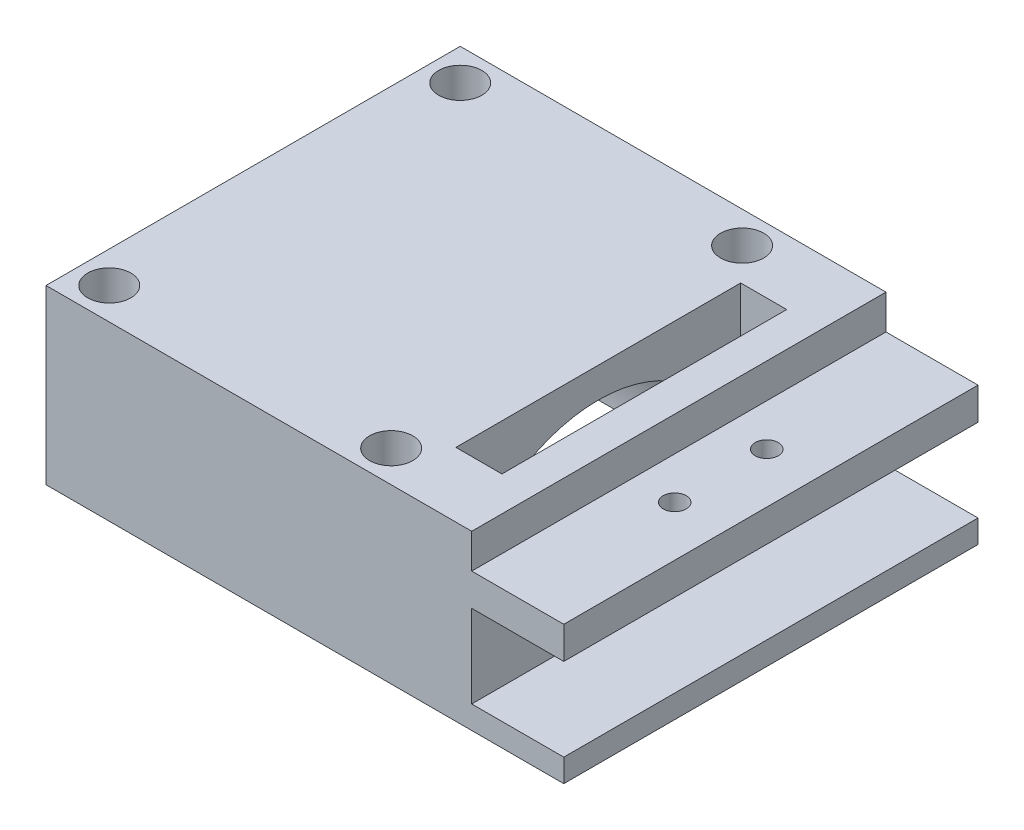
ISO-10303-21;
HEADER;
FILE_DESCRIPTION(('STEP AP214'),'2;1');
FILE_NAME('part.step','',(''),(''),'','','');
FILE_SCHEMA(('AUTOMOTIVE_DESIGN { 1 0 10303 214 1 1 1 1 }'));
ENDSEC;
DATA;
#1=APPLICATION_CONTEXT('core data for automotive mechanical design processes');
#2=APPLICATION_PROTOCOL_DEFINITION('international standard','automotive_design',2000,#1);
#3=PRODUCT_CONTEXT('',#1,'mechanical');
#4=PRODUCT('Part','Part','',(#3));
#5=PRODUCT_RELATED_PRODUCT_CATEGORY('part','',(#4));
#6=PRODUCT_DEFINITION_FORMATION('','',#4);
#7=PRODUCT_DEFINITION_CONTEXT('part definition',#1,'design');
#8=PRODUCT_DEFINITION('design','',#6,#7);
#9=PRODUCT_DEFINITION_SHAPE('','',#8);
#10=(LENGTH_UNIT() NAMED_UNIT(*) SI_UNIT(.MILLI.,.METRE.));
#11=(NAMED_UNIT(*) PLANE_ANGLE_UNIT() SI_UNIT($,.RADIAN.));
#12=(NAMED_UNIT(*) SI_UNIT($,.STERADIAN.) SOLID_ANGLE_UNIT());
#13=UNCERTAINTY_MEASURE_WITH_UNIT(LENGTH_MEASURE(1.E-05),#10,'distance_accuracy_value','');
#14=(GEOMETRIC_REPRESENTATION_CONTEXT(3) GLOBAL_UNCERTAINTY_ASSIGNED_CONTEXT((#13)) GLOBAL_UNIT_ASSIGNED_CONTEXT((#10,
#11,#12)) REPRESENTATION_CONTEXT('',''));
#15=CARTESIAN_POINT('',(0.,0.,0.));
#16=DIRECTION('',(0.,0.,1.));
#17=DIRECTION('',(1.,0.,0.));
#18=AXIS2_PLACEMENT_3D('',#15,#16,#17);
#19=CARTESIAN_POINT('',(22.,0.,0.));
#20=DIRECTION('',(1.,0.,0.));
#21=DIRECTION('',(0.,0.,-1.));
#22=AXIS2_PLACEMENT_3D('',#19,#20,#21);
#23=PLANE('',#22);
#24=DIRECTION('',(0.,-1.,0.));
#25=VECTOR('',#24,1.);
#26=CARTESIAN_POINT('',(22.,30.,18.));
#27=LINE('',#26,#25);
#28=CARTESIAN_POINT('',(22.,24.2,18.));
#29=VERTEX_POINT('',#28);
#30=CARTESIAN_POINT('',(22.,17.,18.));
#31=VERTEX_POINT('',#30);
#32=EDGE_CURVE('E231',#29,#31,#27,.T.);
#33=ORIENTED_EDGE('',*,*,#32,.T.);
#34=DIRECTION('',(0.,0.,1.));
#35=VECTOR('',#34,1.);
#36=CARTESIAN_POINT('',(22.,17.,-18.));
#37=LINE('',#36,#35);
#38=CARTESIAN_POINT('',(22.,17.,-18.));
#39=VERTEX_POINT('',#38);
#40=EDGE_CURVE('E75',#39,#31,#37,.T.);
#41=ORIENTED_EDGE('',*,*,#40,.F.);
#42=DIRECTION('',(0.,1.,0.));
#43=VECTOR('',#42,1.);
#44=CARTESIAN_POINT('',(22.,15.,-18.));
#45=LINE('',#44,#43);
#46=CARTESIAN_POINT('',(22.,24.2,-18.));
#47=VERTEX_POINT('',#46);
#48=EDGE_CURVE('E223',#39,#47,#45,.T.);
#49=ORIENTED_EDGE('',*,*,#48,.T.);
#50=DIRECTION('',(0.,0.,-1.));
#51=VECTOR('',#50,1.);
#52=CARTESIAN_POINT('',(22.,24.2,18.));
#53=LINE('',#52,#51);
#54=EDGE_CURVE('E194',#29,#47,#53,.T.);
#55=ORIENTED_EDGE('',*,*,#54,.F.);
#56=EDGE_LOOP('',(#33,#41,#49,#55));
#57=FACE_BOUND('',#56,.T.);
#58=ADVANCED_FACE('F49',(#57),#23,.T.);
#59=CARTESIAN_POINT('',(22.,30.,12.375));
#60=DIRECTION('',(0.,0.,1.));
#61=DIRECTION('',(1.,0.,0.));
#62=AXIS2_PLACEMENT_3D('',#59,#60,#61);
#63=PLANE('',#62);
#64=DIRECTION('',(0.,-1.,0.));
#65=VECTOR('',#64,1.);
#66=CARTESIAN_POINT('',(19.,30.,12.375));
#67=LINE('',#66,#65);
#68=CARTESIAN_POINT('',(19.,30.,12.375));
#69=VERTEX_POINT('',#68);
#70=CARTESIAN_POINT('',(19.,15.,12.375));
#71=VERTEX_POINT('',#70);
#72=EDGE_CURVE('E201',#69,#71,#67,.T.);
#73=ORIENTED_EDGE('',*,*,#72,.T.);
#74=DIRECTION('',(-1.,0.,0.));
#75=VECTOR('',#74,1.);
#76=CARTESIAN_POINT('',(22.,15.,12.375));
#77=LINE('',#76,#75);
#78=CARTESIAN_POINT('',(15.,15.,12.375));
#79=VERTEX_POINT('',#78);
#80=EDGE_CURVE('E240',#71,#79,#77,.T.);
#81=ORIENTED_EDGE('',*,*,#80,.T.);
#82=DIRECTION('',(0.,1.,0.));
#83=VECTOR('',#82,1.);
#84=CARTESIAN_POINT('',(15.,30.,12.375));
#85=LINE('',#84,#83);
#86=CARTESIAN_POINT('',(15.,30.,12.375));
#87=VERTEX_POINT('',#86);
#88=EDGE_CURVE('E228',#79,#87,#85,.T.);
#89=ORIENTED_EDGE('',*,*,#88,.T.);
#90=DIRECTION('',(-1.,0.,0.));
#91=VECTOR('',#90,1.);
#92=CARTESIAN_POINT('',(22.,30.,12.375));
#93=LINE('',#92,#91);
#94=EDGE_CURVE('E234',#69,#87,#93,.T.);
#95=ORIENTED_EDGE('',*,*,#94,.F.);
#96=EDGE_LOOP('',(#73,#81,#89,#95));
#97=FACE_BOUND('',#96,.T.);
#98=ADVANCED_FACE('F354',(#97),#63,.F.);
#99=CARTESIAN_POINT('',(22.,15.,-12.375));
#100=DIRECTION('',(0.,0.,-1.));
#101=DIRECTION('',(-1.,0.,0.));
#102=AXIS2_PLACEMENT_3D('',#99,#100,#101);
#103=PLANE('',#102);
#104=DIRECTION('',(0.,1.,0.));
#105=VECTOR('',#104,1.);
#106=CARTESIAN_POINT('',(19.,30.,-12.375));
#107=LINE('',#106,#105);
#108=CARTESIAN_POINT('',(19.,15.,-12.375));
#109=VERTEX_POINT('',#108);
#110=CARTESIAN_POINT('',(19.,30.,-12.375));
#111=VERTEX_POINT('',#110);
#112=EDGE_CURVE('E209',#109,#111,#107,.T.);
#113=ORIENTED_EDGE('',*,*,#112,.T.);
#114=DIRECTION('',(-1.,0.,0.));
#115=VECTOR('',#114,1.);
#116=CARTESIAN_POINT('',(22.,30.,-12.375));
#117=LINE('',#116,#115);
#118=CARTESIAN_POINT('',(15.,30.,-12.375));
#119=VERTEX_POINT('',#118);
#120=EDGE_CURVE('E220',#111,#119,#117,.T.);
#121=ORIENTED_EDGE('',*,*,#120,.T.);
#122=DIRECTION('',(0.,-1.,0.));
#123=VECTOR('',#122,1.);
#124=CARTESIAN_POINT('',(15.,15.,-12.375));
#125=LINE('',#124,#123);
#126=CARTESIAN_POINT('',(15.,15.,-12.375));
#127=VERTEX_POINT('',#126);
#128=EDGE_CURVE('E224',#119,#127,#125,.T.);
#129=ORIENTED_EDGE('',*,*,#128,.T.);
#130=DIRECTION('',(-1.,0.,0.));
#131=VECTOR('',#130,1.);
#132=CARTESIAN_POINT('',(22.,15.,-12.375));
#133=LINE('',#132,#131);
#134=EDGE_CURVE('E217',#109,#127,#133,.T.);
#135=ORIENTED_EDGE('',*,*,#134,.F.);
#136=EDGE_LOOP('',(#113,#121,#129,#135));
#137=FACE_BOUND('',#136,.T.);
#138=ADVANCED_FACE('F359',(#137),#103,.F.);
#139=CARTESIAN_POINT('',(15.,30.,18.));
#140=DIRECTION('',(-1.,0.,0.));
#141=DIRECTION('',(0.,0.,1.));
#142=AXIS2_PLACEMENT_3D('',#139,#140,#141);
#143=PLANE('',#142);
#144=ORIENTED_EDGE('',*,*,#128,.F.);
#145=DIRECTION('',(0.,0.,-1.));
#146=VECTOR('',#145,1.);
#147=CARTESIAN_POINT('',(15.,30.,18.));
#148=LINE('',#147,#146);
#149=EDGE_CURVE('E295',#87,#119,#148,.T.);
#150=ORIENTED_EDGE('',*,*,#149,.F.);
#151=ORIENTED_EDGE('',*,*,#88,.F.);
#152=CARTESIAN_POINT('',(15.,15.,0.));
#153=DIRECTION('',(1.,0.,0.));
#154=DIRECTION('',(0.,0.,-1.));
#155=AXIS2_PLACEMENT_3D('',#152,#153,#154);
#156=CIRCLE('',#155,12.375);
#157=EDGE_CURVE('E290',#127,#79,#156,.T.);
#158=ORIENTED_EDGE('',*,*,#157,.F.);
#159=EDGE_LOOP('',(#144,#150,#151,#158));
#160=FACE_BOUND('',#159,.T.);
#161=ADVANCED_FACE('F51',(#160),#143,.F.);
#162=CARTESIAN_POINT('',(-15.,30.,-18.));
#163=DIRECTION('',(0.,0.,1.));
#164=DIRECTION('',(1.,0.,0.));
#165=AXIS2_PLACEMENT_3D('',#162,#163,#164);
#166=PLANE('',#165);
#167=DIRECTION('',(-1.,0.,0.));
#168=VECTOR('',#167,1.);
#169=CARTESIAN_POINT('',(-15.,30.,-18.));
#170=LINE('',#169,#168);
#171=CARTESIAN_POINT('',(22.,30.,-18.));
#172=VERTEX_POINT('',#171);
#173=CARTESIAN_POINT('',(-15.,30.,-18.));
#174=VERTEX_POINT('',#173);
#175=EDGE_CURVE('E299',#172,#174,#170,.T.);
#176=ORIENTED_EDGE('',*,*,#175,.F.);
#177=DIRECTION('',(0.,1.,0.));
#178=VECTOR('',#177,1.);
#179=CARTESIAN_POINT('',(22.,27.,-18.));
#180=LINE('',#179,#178);
#181=CARTESIAN_POINT('',(22.,27.,-18.));
#182=VERTEX_POINT('',#181);
#183=EDGE_CURVE('E175',#182,#172,#180,.T.);
#184=ORIENTED_EDGE('',*,*,#183,.F.);
#185=DIRECTION('',(-1.,0.,0.));
#186=VECTOR('',#185,1.);
#187=CARTESIAN_POINT('',(30.,27.,-18.));
#188=LINE('',#187,#186);
#189=CARTESIAN_POINT('',(30.,27.,-18.));
#190=VERTEX_POINT('',#189);
#191=EDGE_CURVE('E161',#190,#182,#188,.T.);
#192=ORIENTED_EDGE('',*,*,#191,.F.);
#193=DIRECTION('',(0.,1.,0.));
#194=VECTOR('',#193,1.);
#195=CARTESIAN_POINT('',(30.,30.,-18.));
#196=LINE('',#195,#194);
#197=CARTESIAN_POINT('',(30.,24.2,-18.));
#198=VERTEX_POINT('',#197);
#199=EDGE_CURVE('E174',#198,#190,#196,.T.);
#200=ORIENTED_EDGE('',*,*,#199,.F.);
#201=DIRECTION('',(-1.,0.,0.));
#202=VECTOR('',#201,1.);
#203=CARTESIAN_POINT('',(30.,24.2,-18.));
#204=LINE('',#203,#202);
#205=EDGE_CURVE('E184',#198,#47,#204,.T.);
#206=ORIENTED_EDGE('',*,*,#205,.T.);
#207=ORIENTED_EDGE('',*,*,#48,.F.);
#208=DIRECTION('',(-1.,0.,0.));
#209=VECTOR('',#208,1.);
#210=CARTESIAN_POINT('',(30.,17.,-18.));
#211=LINE('',#210,#209);
#212=CARTESIAN_POINT('',(30.,17.,-18.));
#213=VERTEX_POINT('',#212);
#214=EDGE_CURVE('E418',#213,#39,#211,.T.);
#215=ORIENTED_EDGE('',*,*,#214,.F.);
#216=DIRECTION('',(0.,1.,0.));
#217=VECTOR('',#216,1.);
#218=CARTESIAN_POINT('',(30.,15.,-18.));
#219=LINE('',#218,#217);
#220=CARTESIAN_POINT('',(30.,15.,-18.));
#221=VERTEX_POINT('',#220);
#222=EDGE_CURVE('E431',#221,#213,#219,.T.);
#223=ORIENTED_EDGE('',*,*,#222,.F.);
#224=DIRECTION('',(1.,0.,0.));
#225=VECTOR('',#224,1.);
#226=CARTESIAN_POINT('',(-15.,15.,-18.));
#227=LINE('',#226,#225);
#228=CARTESIAN_POINT('',(-15.,15.,-18.));
#229=VERTEX_POINT('',#228);
#230=EDGE_CURVE('E249',#229,#221,#227,.T.);
#231=ORIENTED_EDGE('',*,*,#230,.F.);
#232=DIRECTION('',(0.,-1.,0.));
#233=VECTOR('',#232,1.);
#234=CARTESIAN_POINT('',(-15.,30.,-18.));
#235=LINE('',#234,#233);
#236=EDGE_CURVE('E11',#174,#229,#235,.T.);
#237=ORIENTED_EDGE('',*,*,#236,.F.);
#238=EDGE_LOOP('',(#176,#184,#192,#200,#206,#207,#215,#223,#231,#237));
#239=FACE_BOUND('',#238,.T.);
#240=ADVANCED_FACE('F172',(#239),#166,.F.);
#241=CARTESIAN_POINT('',(-15.,30.,18.));
#242=DIRECTION('',(1.,0.,0.));
#243=DIRECTION('',(0.,0.,-1.));
#244=AXIS2_PLACEMENT_3D('',#241,#242,#243);
#245=PLANE('',#244);
#246=ORIENTED_EDGE('',*,*,#236,.T.);
#247=DIRECTION('',(0.,0.,1.));
#248=VECTOR('',#247,1.);
#249=CARTESIAN_POINT('',(-15.,15.,18.));
#250=LINE('',#249,#248);
#251=CARTESIAN_POINT('',(-15.,15.,-12.375));
#252=VERTEX_POINT('',#251);
#253=EDGE_CURVE('E244',#229,#252,#250,.T.);
#254=ORIENTED_EDGE('',*,*,#253,.T.);
#255=CARTESIAN_POINT('',(-15.,15.,0.));
#256=DIRECTION('',(1.,0.,0.));
#257=DIRECTION('',(0.,0.,-1.));
#258=AXIS2_PLACEMENT_3D('',#255,#256,#257);
#259=CIRCLE('',#258,12.375);
#260=CARTESIAN_POINT('',(-15.,15.,12.375));
#261=VERTEX_POINT('',#260);
#262=EDGE_CURVE('E294',#252,#261,#259,.T.);
#263=ORIENTED_EDGE('',*,*,#262,.T.);
#264=CARTESIAN_POINT('',(-15.,15.,18.));
#265=VERTEX_POINT('',#264);
#266=EDGE_CURVE('E243',#261,#265,#250,.T.);
#267=ORIENTED_EDGE('',*,*,#266,.T.);
#268=DIRECTION('',(0.,-1.,0.));
#269=VECTOR('',#268,1.);
#270=CARTESIAN_POINT('',(-15.,30.,18.));
#271=LINE('',#270,#269);
#272=CARTESIAN_POINT('',(-15.,30.,18.));
#273=VERTEX_POINT('',#272);
#274=EDGE_CURVE('E59',#273,#265,#271,.T.);
#275=ORIENTED_EDGE('',*,*,#274,.F.);
#276=DIRECTION('',(0.,0.,1.));
#277=VECTOR('',#276,1.);
#278=CARTESIAN_POINT('',(-15.,30.,18.));
#279=LINE('',#278,#277);
#280=EDGE_CURVE('E302',#174,#273,#279,.T.);
#281=ORIENTED_EDGE('',*,*,#280,.F.);
#282=EDGE_LOOP('',(#246,#254,#263,#267,#275,#281));
#283=FACE_BOUND('',#282,.T.);
#284=ADVANCED_FACE('F316',(#283),#245,.F.);
#285=CARTESIAN_POINT('',(-15.,30.,18.));
#286=DIRECTION('',(0.,0.,-1.));
#287=DIRECTION('',(-1.,0.,0.));
#288=AXIS2_PLACEMENT_3D('',#285,#286,#287);
#289=PLANE('',#288);
#290=DIRECTION('',(1.,0.,0.));
#291=VECTOR('',#290,1.);
#292=CARTESIAN_POINT('',(30.,27.,18.));
#293=LINE('',#292,#291);
#294=CARTESIAN_POINT('',(22.,27.,18.));
#295=VERTEX_POINT('',#294);
#296=CARTESIAN_POINT('',(30.,27.,18.));
#297=VERTEX_POINT('',#296);
#298=EDGE_CURVE('E67',#295,#297,#293,.T.);
#299=ORIENTED_EDGE('',*,*,#298,.F.);
#300=DIRECTION('',(0.,1.,0.));
#301=VECTOR('',#300,1.);
#302=CARTESIAN_POINT('',(22.,27.,18.));
#303=LINE('',#302,#301);
#304=CARTESIAN_POINT('',(22.,30.,18.));
#305=VERTEX_POINT('',#304);
#306=EDGE_CURVE('E414',#295,#305,#303,.T.);
#307=ORIENTED_EDGE('',*,*,#306,.T.);
#308=DIRECTION('',(1.,0.,0.));
#309=VECTOR('',#308,1.);
#310=CARTESIAN_POINT('',(-15.,30.,18.));
#311=LINE('',#310,#309);
#312=EDGE_CURVE('E305',#273,#305,#311,.T.);
#313=ORIENTED_EDGE('',*,*,#312,.F.);
#314=ORIENTED_EDGE('',*,*,#274,.T.);
#315=DIRECTION('',(1.,0.,0.));
#316=VECTOR('',#315,1.);
#317=CARTESIAN_POINT('',(-15.,15.,18.));
#318=LINE('',#317,#316);
#319=CARTESIAN_POINT('',(30.,15.,18.));
#320=VERTEX_POINT('',#319);
#321=EDGE_CURVE('E248',#265,#320,#318,.T.);
#322=ORIENTED_EDGE('',*,*,#321,.T.);
#323=DIRECTION('',(0.,-1.,0.));
#324=VECTOR('',#323,1.);
#325=CARTESIAN_POINT('',(30.,15.,18.));
#326=LINE('',#325,#324);
#327=CARTESIAN_POINT('',(30.,17.,18.));
#328=VERTEX_POINT('',#327);
#329=EDGE_CURVE('E435',#328,#320,#326,.T.);
#330=ORIENTED_EDGE('',*,*,#329,.F.);
#331=DIRECTION('',(-1.,0.,0.));
#332=VECTOR('',#331,1.);
#333=CARTESIAN_POINT('',(30.,17.,18.));
#334=LINE('',#333,#332);
#335=EDGE_CURVE('E424',#328,#31,#334,.T.);
#336=ORIENTED_EDGE('',*,*,#335,.T.);
#337=ORIENTED_EDGE('',*,*,#32,.F.);
#338=DIRECTION('',(-1.,0.,0.));
#339=VECTOR('',#338,1.);
#340=CARTESIAN_POINT('',(30.,24.2,18.));
#341=LINE('',#340,#339);
#342=CARTESIAN_POINT('',(30.,24.2,18.));
#343=VERTEX_POINT('',#342);
#344=EDGE_CURVE('E188',#343,#29,#341,.T.);
#345=ORIENTED_EDGE('',*,*,#344,.F.);
#346=DIRECTION('',(0.,-1.,0.));
#347=VECTOR('',#346,1.);
#348=CARTESIAN_POINT('',(30.,30.,18.));
#349=LINE('',#348,#347);
#350=EDGE_CURVE('E190',#297,#343,#349,.T.);
#351=ORIENTED_EDGE('',*,*,#350,.F.);
#352=EDGE_LOOP('',(#299,#307,#313,#314,#322,#330,#336,#337,#345,#351));
#353=FACE_BOUND('',#352,.T.);
#354=ADVANCED_FACE('F449',(#353),#289,.F.);
#355=CARTESIAN_POINT('',(0.,30.,0.));
#356=DIRECTION('',(0.,-1.,0.));
#357=DIRECTION('',(0.,0.,-1.));
#358=AXIS2_PLACEMENT_3D('',#355,#356,#357);
#359=PLANE('',#358);
#360=DIRECTION('',(0.,0.,1.));
#361=VECTOR('',#360,1.);
#362=CARTESIAN_POINT('',(19.,30.,12.375));
#363=LINE('',#362,#361);
#364=EDGE_CURVE('E213',#111,#69,#363,.T.);
#365=ORIENTED_EDGE('',*,*,#364,.T.);
#366=ORIENTED_EDGE('',*,*,#94,.T.);
#367=ORIENTED_EDGE('',*,*,#149,.T.);
#368=ORIENTED_EDGE('',*,*,#120,.F.);
#369=EDGE_LOOP('',(#365,#366,#367,#368));
#370=FACE_BOUND('',#369,.T.);
#371=CARTESIAN_POINT('',(12.25,30.,-15.25));
#372=DIRECTION('',(0.,1.,0.));
#373=DIRECTION('',(0.,0.,-1.));
#374=AXIS2_PLACEMENT_3D('',#371,#372,#373);
#375=CIRCLE('',#374,1.875);
#376=CARTESIAN_POINT('',(12.25,30.,-17.125));
#377=VERTEX_POINT('',#376);
#378=EDGE_CURVE('E274',#377,#377,#375,.T.);
#379=ORIENTED_EDGE('',*,*,#378,.F.);
#380=EDGE_LOOP('',(#379));
#381=FACE_BOUND('',#380,.T.);
#382=CARTESIAN_POINT('',(12.25,30.,15.25));
#383=DIRECTION('',(0.,1.,0.));
#384=DIRECTION('',(0.,0.,1.));
#385=AXIS2_PLACEMENT_3D('',#382,#383,#384);
#386=CIRCLE('',#385,1.875);
#387=CARTESIAN_POINT('',(12.25,30.,17.125));
#388=VERTEX_POINT('',#387);
#389=EDGE_CURVE('E280',#388,#388,#386,.T.);
#390=ORIENTED_EDGE('',*,*,#389,.F.);
#391=EDGE_LOOP('',(#390));
#392=FACE_BOUND('',#391,.T.);
#393=CARTESIAN_POINT('',(-12.25,30.,15.25));
#394=DIRECTION('',(0.,1.,0.));
#395=DIRECTION('',(0.,0.,-1.));
#396=AXIS2_PLACEMENT_3D('',#393,#394,#395);
#397=CIRCLE('',#396,1.875);
#398=CARTESIAN_POINT('',(-12.25,30.,13.375));
#399=VERTEX_POINT('',#398);
#400=EDGE_CURVE('E275',#399,#399,#397,.T.);
#401=ORIENTED_EDGE('',*,*,#400,.F.);
#402=EDGE_LOOP('',(#401));
#403=FACE_BOUND('',#402,.T.);
#404=CARTESIAN_POINT('',(-12.25,30.,-15.25));
#405=DIRECTION('',(0.,1.,0.));
#406=DIRECTION('',(0.,0.,1.));
#407=AXIS2_PLACEMENT_3D('',#404,#405,#406);
#408=CIRCLE('',#407,1.875);
#409=CARTESIAN_POINT('',(-12.25,30.,-13.375));
#410=VERTEX_POINT('',#409);
#411=EDGE_CURVE('E279',#410,#410,#408,.T.);
#412=ORIENTED_EDGE('',*,*,#411,.F.);
#413=EDGE_LOOP('',(#412));
#414=FACE_BOUND('',#413,.T.);
#415=ORIENTED_EDGE('',*,*,#312,.T.);
#416=DIRECTION('',(0.,0.,1.));
#417=VECTOR('',#416,1.);
#418=CARTESIAN_POINT('',(22.,30.,-18.));
#419=LINE('',#418,#417);
#420=EDGE_CURVE('E167',#172,#305,#419,.T.);
#421=ORIENTED_EDGE('',*,*,#420,.F.);
#422=ORIENTED_EDGE('',*,*,#175,.T.);
#423=ORIENTED_EDGE('',*,*,#280,.T.);
#424=EDGE_LOOP('',(#415,#421,#422,#423));
#425=FACE_BOUND('',#424,.T.);
#426=ADVANCED_FACE('F463',(#370,#381,#392,#403,#414,#425),#359,.F.);
#427=CARTESIAN_POINT('',(-25.,15.,0.));
#428=DIRECTION('',(1.,0.,0.));
#429=DIRECTION('',(0.,0.,-1.));
#430=AXIS2_PLACEMENT_3D('',#427,#428,#429);
#431=CYLINDRICAL_SURFACE('',#430,12.375);
#432=ORIENTED_EDGE('',*,*,#157,.T.);
#433=DIRECTION('',(1.,0.,0.));
#434=VECTOR('',#433,1.);
#435=CARTESIAN_POINT('',(-25.,15.,12.375));
#436=LINE('',#435,#434);
#437=EDGE_CURVE('E270',#79,#261,#436,.F.);
#438=ORIENTED_EDGE('',*,*,#437,.T.);
#439=ORIENTED_EDGE('',*,*,#262,.F.);
#440=DIRECTION('',(1.,0.,0.));
#441=VECTOR('',#440,1.);
#442=CARTESIAN_POINT('',(-25.,15.,-12.375));
#443=LINE('',#442,#441);
#444=EDGE_CURVE('E266',#252,#127,#443,.T.);
#445=ORIENTED_EDGE('',*,*,#444,.T.);
#446=EDGE_LOOP('',(#432,#438,#439,#445));
#447=FACE_BOUND('',#446,.T.);
#448=ADVANCED_FACE('F319',(#447),#431,.F.);
#449=CARTESIAN_POINT('',(-12.25,-10.,-15.25));
#450=DIRECTION('',(0.,1.,0.));
#451=DIRECTION('',(0.,0.,1.));
#452=AXIS2_PLACEMENT_3D('',#449,#450,#451);
#453=CYLINDRICAL_SURFACE('',#452,1.875);
#454=CARTESIAN_POINT('',(-12.25,15.,-15.25));
#455=DIRECTION('',(0.,1.,0.));
#456=DIRECTION('',(0.,0.,1.));
#457=AXIS2_PLACEMENT_3D('',#454,#455,#456);
#458=CIRCLE('',#457,1.875);
#459=CARTESIAN_POINT('',(-12.25,15.,-13.375));
#460=VERTEX_POINT('',#459);
#461=EDGE_CURVE('E262',#460,#460,#458,.F.);
#462=ORIENTED_EDGE('',*,*,#461,.T.);
#463=EDGE_LOOP('',(#462));
#464=FACE_BOUND('',#463,.T.);
#465=ORIENTED_EDGE('',*,*,#411,.T.);
#466=EDGE_LOOP('',(#465));
#467=FACE_BOUND('',#466,.T.);
#468=ADVANCED_FACE('F480',(#464,#467),#453,.F.);
#469=CARTESIAN_POINT('',(-12.25,-10.,15.25));
#470=DIRECTION('',(0.,1.,0.));
#471=DIRECTION('',(0.,0.,1.));
#472=AXIS2_PLACEMENT_3D('',#469,#470,#471);
#473=CYLINDRICAL_SURFACE('',#472,1.875);
#474=CARTESIAN_POINT('',(-12.25,15.,15.25));
#475=DIRECTION('',(0.,1.,0.));
#476=DIRECTION('',(0.,0.,1.));
#477=AXIS2_PLACEMENT_3D('',#474,#475,#476);
#478=CIRCLE('',#477,1.875);
#479=CARTESIAN_POINT('',(-12.25,15.,17.125));
#480=VERTEX_POINT('',#479);
#481=EDGE_CURVE('E258',#480,#480,#478,.F.);
#482=ORIENTED_EDGE('',*,*,#481,.T.);
#483=EDGE_LOOP('',(#482));
#484=FACE_BOUND('',#483,.T.);
#485=ORIENTED_EDGE('',*,*,#400,.T.);
#486=EDGE_LOOP('',(#485));
#487=FACE_BOUND('',#486,.T.);
#488=ADVANCED_FACE('F482',(#484,#487),#473,.F.);
#489=CARTESIAN_POINT('',(12.25,-10.,15.25));
#490=DIRECTION('',(0.,1.,0.));
#491=DIRECTION('',(0.,0.,1.));
#492=AXIS2_PLACEMENT_3D('',#489,#490,#491);
#493=CYLINDRICAL_SURFACE('',#492,1.875);
#494=CARTESIAN_POINT('',(12.25,15.,15.25));
#495=DIRECTION('',(0.,1.,0.));
#496=DIRECTION('',(0.,0.,1.));
#497=AXIS2_PLACEMENT_3D('',#494,#495,#496);
#498=CIRCLE('',#497,1.875);
#499=CARTESIAN_POINT('',(12.25,15.,17.125));
#500=VERTEX_POINT('',#499);
#501=EDGE_CURVE('E254',#500,#500,#498,.F.);
#502=ORIENTED_EDGE('',*,*,#501,.T.);
#503=EDGE_LOOP('',(#502));
#504=FACE_BOUND('',#503,.T.);
#505=ORIENTED_EDGE('',*,*,#389,.T.);
#506=EDGE_LOOP('',(#505));
#507=FACE_BOUND('',#506,.T.);
#508=ADVANCED_FACE('F348',(#504,#507),#493,.F.);
#509=CARTESIAN_POINT('',(12.25,-10.,-15.25));
#510=DIRECTION('',(0.,1.,0.));
#511=DIRECTION('',(0.,0.,1.));
#512=AXIS2_PLACEMENT_3D('',#509,#510,#511);
#513=CYLINDRICAL_SURFACE('',#512,1.875);
#514=CARTESIAN_POINT('',(12.25,15.,-15.25));
#515=DIRECTION('',(0.,1.,0.));
#516=DIRECTION('',(0.,0.,1.));
#517=AXIS2_PLACEMENT_3D('',#514,#515,#516);
#518=CIRCLE('',#517,1.875);
#519=CARTESIAN_POINT('',(12.25,15.,-13.375));
#520=VERTEX_POINT('',#519);
#521=EDGE_CURVE('E53',#520,#520,#518,.F.);
#522=ORIENTED_EDGE('',*,*,#521,.T.);
#523=EDGE_LOOP('',(#522));
#524=FACE_BOUND('',#523,.T.);
#525=ORIENTED_EDGE('',*,*,#378,.T.);
#526=EDGE_LOOP('',(#525));
#527=FACE_BOUND('',#526,.T.);
#528=ADVANCED_FACE('F332',(#524,#527),#513,.F.);
#529=CARTESIAN_POINT('',(-15.,15.,18.));
#530=DIRECTION('',(0.,1.,0.));
#531=DIRECTION('',(0.,0.,1.));
#532=AXIS2_PLACEMENT_3D('',#529,#530,#531);
#533=PLANE('',#532);
#534=ORIENTED_EDGE('',*,*,#481,.F.);
#535=EDGE_LOOP('',(#534));
#536=FACE_BOUND('',#535,.T.);
#537=ORIENTED_EDGE('',*,*,#501,.F.);
#538=EDGE_LOOP('',(#537));
#539=FACE_BOUND('',#538,.T.);
#540=ORIENTED_EDGE('',*,*,#437,.F.);
#541=ORIENTED_EDGE('',*,*,#80,.F.);
#542=DIRECTION('',(0.,0.,-1.));
#543=VECTOR('',#542,1.);
#544=CARTESIAN_POINT('',(19.,15.,12.375));
#545=LINE('',#544,#543);
#546=EDGE_CURVE('E205',#71,#109,#545,.T.);
#547=ORIENTED_EDGE('',*,*,#546,.T.);
#548=ORIENTED_EDGE('',*,*,#134,.T.);
#549=ORIENTED_EDGE('',*,*,#444,.F.);
#550=ORIENTED_EDGE('',*,*,#253,.F.);
#551=ORIENTED_EDGE('',*,*,#230,.T.);
#552=DIRECTION('',(0.,0.,-1.));
#553=VECTOR('',#552,1.);
#554=CARTESIAN_POINT('',(30.,15.,-18.));
#555=LINE('',#554,#553);
#556=EDGE_CURVE('E428',#320,#221,#555,.T.);
#557=ORIENTED_EDGE('',*,*,#556,.F.);
#558=ORIENTED_EDGE('',*,*,#321,.F.);
#559=ORIENTED_EDGE('',*,*,#266,.F.);
#560=EDGE_LOOP('',(#540,#541,#547,#548,#549,#550,#551,#557,#558,#559));
#561=FACE_BOUND('',#560,.T.);
#562=ORIENTED_EDGE('',*,*,#461,.F.);
#563=EDGE_LOOP('',(#562));
#564=FACE_BOUND('',#563,.T.);
#565=ORIENTED_EDGE('',*,*,#521,.F.);
#566=EDGE_LOOP('',(#565));
#567=FACE_BOUND('',#566,.T.);
#568=ADVANCED_FACE('F324',(#536,#539,#561,#564,#567),#533,.F.);
#569=CARTESIAN_POINT('',(19.,0.,0.));
#570=DIRECTION('',(1.,0.,0.));
#571=DIRECTION('',(0.,0.,-1.));
#572=AXIS2_PLACEMENT_3D('',#569,#570,#571);
#573=PLANE('',#572);
#574=ORIENTED_EDGE('',*,*,#72,.F.);
#575=ORIENTED_EDGE('',*,*,#364,.F.);
#576=ORIENTED_EDGE('',*,*,#112,.F.);
#577=ORIENTED_EDGE('',*,*,#546,.F.);
#578=EDGE_LOOP('',(#574,#575,#576,#577));
#579=FACE_BOUND('',#578,.T.);
#580=ADVANCED_FACE('F336',(#579),#573,.F.);
#581=CARTESIAN_POINT('',(30.,24.2,18.));
#582=DIRECTION('',(0.,1.,0.));
#583=DIRECTION('',(0.,0.,1.));
#584=AXIS2_PLACEMENT_3D('',#581,#582,#583);
#585=PLANE('',#584);
#586=CARTESIAN_POINT('',(25.64,24.2,-4.));
#587=DIRECTION('',(0.,1.,0.));
#588=DIRECTION('',(0.,0.,1.));
#589=AXIS2_PLACEMENT_3D('',#586,#587,#588);
#590=CIRCLE('',#589,1.);
#591=CARTESIAN_POINT('',(25.64,24.2,-3.));
#592=VERTEX_POINT('',#591);
#593=EDGE_CURVE('E399',#592,#592,#590,.T.);
#594=ORIENTED_EDGE('',*,*,#593,.T.);
#595=EDGE_LOOP('',(#594));
#596=FACE_BOUND('',#595,.T.);
#597=CARTESIAN_POINT('',(25.64,24.2,4.));
#598=DIRECTION('',(0.,1.,0.));
#599=DIRECTION('',(0.,0.,1.));
#600=AXIS2_PLACEMENT_3D('',#597,#598,#599);
#601=CIRCLE('',#600,1.);
#602=CARTESIAN_POINT('',(25.64,24.2,5.));
#603=VERTEX_POINT('',#602);
#604=EDGE_CURVE('E401',#603,#603,#601,.T.);
#605=ORIENTED_EDGE('',*,*,#604,.T.);
#606=EDGE_LOOP('',(#605));
#607=FACE_BOUND('',#606,.T.);
#608=ORIENTED_EDGE('',*,*,#54,.T.);
#609=ORIENTED_EDGE('',*,*,#205,.F.);
#610=DIRECTION('',(0.,0.,-1.));
#611=VECTOR('',#610,1.);
#612=CARTESIAN_POINT('',(30.,24.2,18.));
#613=LINE('',#612,#611);
#614=EDGE_CURVE('E181',#343,#198,#613,.T.);
#615=ORIENTED_EDGE('',*,*,#614,.F.);
#616=ORIENTED_EDGE('',*,*,#344,.T.);
#617=EDGE_LOOP('',(#608,#609,#615,#616));
#618=FACE_BOUND('',#617,.T.);
#619=ADVANCED_FACE('F344',(#596,#607,#618),#585,.F.);
#620=CARTESIAN_POINT('',(30.,0.,0.));
#621=DIRECTION('',(1.,0.,0.));
#622=DIRECTION('',(0.,0.,-1.));
#623=AXIS2_PLACEMENT_3D('',#620,#621,#622);
#624=PLANE('',#623);
#625=DIRECTION('',(0.,0.,-1.));
#626=VECTOR('',#625,1.);
#627=CARTESIAN_POINT('',(30.,27.,-18.));
#628=LINE('',#627,#626);
#629=EDGE_CURVE('E158',#297,#190,#628,.T.);
#630=ORIENTED_EDGE('',*,*,#629,.F.);
#631=ORIENTED_EDGE('',*,*,#350,.T.);
#632=ORIENTED_EDGE('',*,*,#614,.T.);
#633=ORIENTED_EDGE('',*,*,#199,.T.);
#634=EDGE_LOOP('',(#630,#631,#632,#633));
#635=FACE_BOUND('',#634,.T.);
#636=ADVANCED_FACE('F179',(#635),#624,.T.);
#637=CARTESIAN_POINT('',(30.,17.,-18.));
#638=DIRECTION('',(0.,-1.,0.));
#639=DIRECTION('',(0.,0.,-1.));
#640=AXIS2_PLACEMENT_3D('',#637,#638,#639);
#641=PLANE('',#640);
#642=ORIENTED_EDGE('',*,*,#40,.T.);
#643=ORIENTED_EDGE('',*,*,#335,.F.);
#644=DIRECTION('',(0.,0.,1.));
#645=VECTOR('',#644,1.);
#646=CARTESIAN_POINT('',(30.,17.,-18.));
#647=LINE('',#646,#645);
#648=EDGE_CURVE('E439',#213,#328,#647,.T.);
#649=ORIENTED_EDGE('',*,*,#648,.F.);
#650=ORIENTED_EDGE('',*,*,#214,.T.);
#651=EDGE_LOOP('',(#642,#643,#649,#650));
#652=FACE_BOUND('',#651,.T.);
#653=ADVANCED_FACE('F370',(#652),#641,.F.);
#654=CARTESIAN_POINT('',(30.,0.,0.));
#655=DIRECTION('',(1.,0.,0.));
#656=DIRECTION('',(0.,0.,-1.));
#657=AXIS2_PLACEMENT_3D('',#654,#655,#656);
#658=PLANE('',#657);
#659=ORIENTED_EDGE('',*,*,#222,.T.);
#660=ORIENTED_EDGE('',*,*,#648,.T.);
#661=ORIENTED_EDGE('',*,*,#329,.T.);
#662=ORIENTED_EDGE('',*,*,#556,.T.);
#663=EDGE_LOOP('',(#659,#660,#661,#662));
#664=FACE_BOUND('',#663,.T.);
#665=ADVANCED_FACE('F371',(#664),#658,.T.);
#666=CARTESIAN_POINT('',(22.,27.,-18.));
#667=DIRECTION('',(-1.,0.,0.));
#668=DIRECTION('',(0.,0.,1.));
#669=AXIS2_PLACEMENT_3D('',#666,#667,#668);
#670=PLANE('',#669);
#671=ORIENTED_EDGE('',*,*,#420,.T.);
#672=ORIENTED_EDGE('',*,*,#306,.F.);
#673=DIRECTION('',(0.,0.,1.));
#674=VECTOR('',#673,1.);
#675=CARTESIAN_POINT('',(22.,27.,-18.));
#676=LINE('',#675,#674);
#677=EDGE_CURVE('E177',#182,#295,#676,.T.);
#678=ORIENTED_EDGE('',*,*,#677,.F.);
#679=ORIENTED_EDGE('',*,*,#183,.T.);
#680=EDGE_LOOP('',(#671,#672,#678,#679));
#681=FACE_BOUND('',#680,.T.);
#682=ADVANCED_FACE('F374',(#681),#670,.F.);
#683=CARTESIAN_POINT('',(0.,27.,0.));
#684=DIRECTION('',(0.,-1.,0.));
#685=DIRECTION('',(0.,0.,-1.));
#686=AXIS2_PLACEMENT_3D('',#683,#684,#685);
#687=PLANE('',#686);
#688=CARTESIAN_POINT('',(25.64,27.,-4.));
#689=DIRECTION('',(0.,1.,0.));
#690=DIRECTION('',(0.,0.,1.));
#691=AXIS2_PLACEMENT_3D('',#688,#689,#690);
#692=CIRCLE('',#691,1.);
#693=CARTESIAN_POINT('',(25.64,27.,-3.));
#694=VERTEX_POINT('',#693);
#695=EDGE_CURVE('E396',#694,#694,#692,.T.);
#696=ORIENTED_EDGE('',*,*,#695,.F.);
#697=EDGE_LOOP('',(#696));
#698=FACE_BOUND('',#697,.T.);
#699=CARTESIAN_POINT('',(25.64,27.,4.));
#700=DIRECTION('',(0.,1.,0.));
#701=DIRECTION('',(0.,0.,1.));
#702=AXIS2_PLACEMENT_3D('',#699,#700,#701);
#703=CIRCLE('',#702,1.);
#704=CARTESIAN_POINT('',(25.64,27.,5.));
#705=VERTEX_POINT('',#704);
#706=EDGE_CURVE('E693',#705,#705,#703,.T.);
#707=ORIENTED_EDGE('',*,*,#706,.F.);
#708=EDGE_LOOP('',(#707));
#709=FACE_BOUND('',#708,.T.);
#710=ORIENTED_EDGE('',*,*,#629,.T.);
#711=ORIENTED_EDGE('',*,*,#191,.T.);
#712=ORIENTED_EDGE('',*,*,#677,.T.);
#713=ORIENTED_EDGE('',*,*,#298,.T.);
#714=EDGE_LOOP('',(#710,#711,#712,#713));
#715=FACE_BOUND('',#714,.T.);
#716=ADVANCED_FACE('F160',(#698,#709,#715),#687,.F.);
#717=CARTESIAN_POINT('',(25.64,24.,4.));
#718=DIRECTION('',(0.,1.,0.));
#719=DIRECTION('',(0.,0.,1.));
#720=AXIS2_PLACEMENT_3D('',#717,#718,#719);
#721=CYLINDRICAL_SURFACE('',#720,1.);
#722=ORIENTED_EDGE('',*,*,#706,.T.);
#723=EDGE_LOOP('',(#722));
#724=FACE_BOUND('',#723,.T.);
#725=ORIENTED_EDGE('',*,*,#604,.F.);
#726=EDGE_LOOP('',(#725));
#727=FACE_BOUND('',#726,.T.);
#728=ADVANCED_FACE('F383',(#724,#727),#721,.F.);
#729=CARTESIAN_POINT('',(25.64,24.,-4.));
#730=DIRECTION('',(0.,1.,0.));
#731=DIRECTION('',(0.,0.,1.));
#732=AXIS2_PLACEMENT_3D('',#729,#730,#731);
#733=CYLINDRICAL_SURFACE('',#732,1.);
#734=ORIENTED_EDGE('',*,*,#695,.T.);
#735=EDGE_LOOP('',(#734));
#736=FACE_BOUND('',#735,.T.);
#737=ORIENTED_EDGE('',*,*,#593,.F.);
#738=EDGE_LOOP('',(#737));
#739=FACE_BOUND('',#738,.T.);
#740=ADVANCED_FACE('F387',(#736,#739),#733,.F.);
#741=CLOSED_SHELL('',(#58,#98,#138,#161,#240,#284,#354,#426,#448,#468,#488,#508,#528,#568,#580,
#619,#636,#653,#665,#682,#716,#728,#740));
#742=MANIFOLD_SOLID_BREP('B2',#741);
#743=ADVANCED_BREP_SHAPE_REPRESENTATION('',(#18,#742),#14);
#744=SHAPE_DEFINITION_REPRESENTATION(#9,#743);
ENDSEC;
END-ISO-10303-21;
